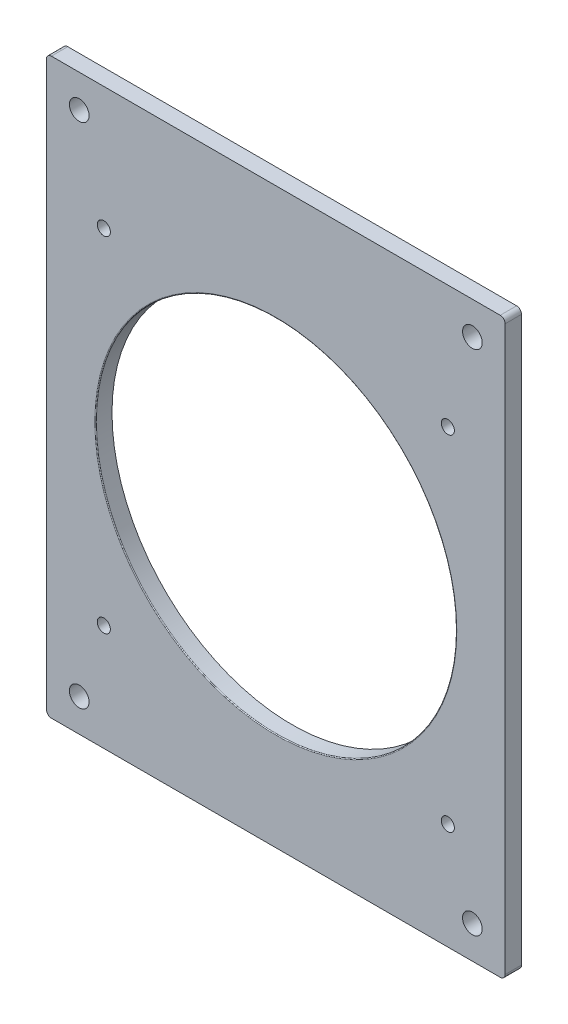
ISO-10303-21;
HEADER;
FILE_DESCRIPTION(('STEP AP214'),'2;1');
FILE_NAME('part.step','',(''),(''),'','','');
FILE_SCHEMA(('AUTOMOTIVE_DESIGN { 1 0 10303 214 1 1 1 1 }'));
ENDSEC;
DATA;
#1=APPLICATION_CONTEXT('core data for automotive mechanical design processes');
#2=APPLICATION_PROTOCOL_DEFINITION('international standard','automotive_design',2000,#1);
#3=PRODUCT_CONTEXT('',#1,'mechanical');
#4=PRODUCT('Part','Part','',(#3));
#5=PRODUCT_RELATED_PRODUCT_CATEGORY('part','',(#4));
#6=PRODUCT_DEFINITION_FORMATION('','',#4);
#7=PRODUCT_DEFINITION_CONTEXT('part definition',#1,'design');
#8=PRODUCT_DEFINITION('design','',#6,#7);
#9=PRODUCT_DEFINITION_SHAPE('','',#8);
#10=(LENGTH_UNIT() NAMED_UNIT(*) SI_UNIT(.MILLI.,.METRE.));
#11=(NAMED_UNIT(*) PLANE_ANGLE_UNIT() SI_UNIT($,.RADIAN.));
#12=(NAMED_UNIT(*) SI_UNIT($,.STERADIAN.) SOLID_ANGLE_UNIT());
#13=UNCERTAINTY_MEASURE_WITH_UNIT(LENGTH_MEASURE(1.E-05),#10,'distance_accuracy_value','');
#14=(GEOMETRIC_REPRESENTATION_CONTEXT(3) GLOBAL_UNCERTAINTY_ASSIGNED_CONTEXT((#13)) GLOBAL_UNIT_ASSIGNED_CONTEXT((#10,
#11,#12)) REPRESENTATION_CONTEXT('',''));
#15=CARTESIAN_POINT('',(0.,0.,0.));
#16=DIRECTION('',(0.,0.,1.));
#17=DIRECTION('',(1.,0.,0.));
#18=AXIS2_PLACEMENT_3D('',#15,#16,#17);
#19=CARTESIAN_POINT('',(68.,-87.5,5.));
#20=DIRECTION('',(0.,1.,0.));
#21=DIRECTION('',(0.,0.,1.));
#22=AXIS2_PLACEMENT_3D('',#19,#20,#21);
#23=PLANE('',#22);
#24=DIRECTION('',(1.,0.,0.));
#25=VECTOR('',#24,1.);
#26=CARTESIAN_POINT('',(68.,-87.5,0.));
#27=LINE('',#26,#25);
#28=CARTESIAN_POINT('',(-68.5,-87.5,0.));
#29=VERTEX_POINT('',#28);
#30=CARTESIAN_POINT('',(68.5,-87.5,0.));
#31=VERTEX_POINT('',#30);
#32=EDGE_CURVE('E100',#29,#31,#27,.T.);
#33=ORIENTED_EDGE('',*,*,#32,.T.);
#34=DIRECTION('',(0.,0.,-1.));
#35=VECTOR('',#34,1.);
#36=CARTESIAN_POINT('',(68.5,-87.5,5.));
#37=LINE('',#36,#35);
#38=CARTESIAN_POINT('',(68.5,-87.5,5.));
#39=VERTEX_POINT('',#38);
#40=EDGE_CURVE('E193',#39,#31,#37,.T.);
#41=ORIENTED_EDGE('',*,*,#40,.F.);
#42=DIRECTION('',(1.,0.,0.));
#43=VECTOR('',#42,1.);
#44=CARTESIAN_POINT('',(-68.,-87.5,5.));
#45=LINE('',#44,#43);
#46=CARTESIAN_POINT('',(-68.5,-87.5,5.));
#47=VERTEX_POINT('',#46);
#48=EDGE_CURVE('E107',#47,#39,#45,.T.);
#49=ORIENTED_EDGE('',*,*,#48,.F.);
#50=DIRECTION('',(0.,0.,-1.));
#51=VECTOR('',#50,1.);
#52=CARTESIAN_POINT('',(-68.5,-87.5,5.));
#53=LINE('',#52,#51);
#54=EDGE_CURVE('E148',#47,#29,#53,.T.);
#55=ORIENTED_EDGE('',*,*,#54,.T.);
#56=EDGE_LOOP('',(#33,#41,#49,#55));
#57=FACE_BOUND('',#56,.T.);
#58=ADVANCED_FACE('F38',(#57),#23,.F.);
#59=CARTESIAN_POINT('',(68.5,-86.,5.));
#60=DIRECTION('',(0.,0.,-1.));
#61=DIRECTION('',(-1.,0.,0.));
#62=AXIS2_PLACEMENT_3D('',#59,#60,#61);
#63=CYLINDRICAL_SURFACE('',#62,1.49999999999999);
#64=CARTESIAN_POINT('',(68.5,-86.,0.));
#65=DIRECTION('',(0.,0.,1.));
#66=DIRECTION('',(1.,0.,0.));
#67=AXIS2_PLACEMENT_3D('',#64,#65,#66);
#68=CIRCLE('',#67,1.49999999999999);
#69=CARTESIAN_POINT('',(70.,-86.,0.));
#70=VERTEX_POINT('',#69);
#71=EDGE_CURVE('E154',#31,#70,#68,.T.);
#72=ORIENTED_EDGE('',*,*,#71,.T.);
#73=DIRECTION('',(0.,0.,-1.));
#74=VECTOR('',#73,1.);
#75=CARTESIAN_POINT('',(70.,-86.,5.));
#76=LINE('',#75,#74);
#77=CARTESIAN_POINT('',(70.,-86.,5.));
#78=VERTEX_POINT('',#77);
#79=EDGE_CURVE('E189',#78,#70,#76,.T.);
#80=ORIENTED_EDGE('',*,*,#79,.F.);
#81=CARTESIAN_POINT('',(68.5,-86.,5.));
#82=DIRECTION('',(0.,0.,1.));
#83=DIRECTION('',(1.,0.,0.));
#84=AXIS2_PLACEMENT_3D('',#81,#82,#83);
#85=CIRCLE('',#84,1.49999999999999);
#86=EDGE_CURVE('E345',#39,#78,#85,.T.);
#87=ORIENTED_EDGE('',*,*,#86,.F.);
#88=ORIENTED_EDGE('',*,*,#40,.T.);
#89=EDGE_LOOP('',(#72,#80,#87,#88));
#90=FACE_BOUND('',#89,.T.);
#91=ADVANCED_FACE('F227',(#90),#63,.T.);
#92=CARTESIAN_POINT('',(70.,86.,5.));
#93=DIRECTION('',(-1.,0.,0.));
#94=DIRECTION('',(0.,-1.,0.));
#95=AXIS2_PLACEMENT_3D('',#92,#93,#94);
#96=PLANE('',#95);
#97=DIRECTION('',(0.,1.,0.));
#98=VECTOR('',#97,1.);
#99=CARTESIAN_POINT('',(70.,86.,0.));
#100=LINE('',#99,#98);
#101=CARTESIAN_POINT('',(70.,86.,0.));
#102=VERTEX_POINT('',#101);
#103=EDGE_CURVE('E159',#70,#102,#100,.T.);
#104=ORIENTED_EDGE('',*,*,#103,.T.);
#105=DIRECTION('',(0.,0.,-1.));
#106=VECTOR('',#105,1.);
#107=CARTESIAN_POINT('',(70.,86.,5.));
#108=LINE('',#107,#106);
#109=CARTESIAN_POINT('',(70.,86.,5.));
#110=VERTEX_POINT('',#109);
#111=EDGE_CURVE('E185',#110,#102,#108,.T.);
#112=ORIENTED_EDGE('',*,*,#111,.F.);
#113=DIRECTION('',(0.,1.,0.));
#114=VECTOR('',#113,1.);
#115=CARTESIAN_POINT('',(70.,-86.,5.));
#116=LINE('',#115,#114);
#117=EDGE_CURVE('E348',#78,#110,#116,.T.);
#118=ORIENTED_EDGE('',*,*,#117,.F.);
#119=ORIENTED_EDGE('',*,*,#79,.T.);
#120=EDGE_LOOP('',(#104,#112,#118,#119));
#121=FACE_BOUND('',#120,.T.);
#122=ADVANCED_FACE('F232',(#121),#96,.F.);
#123=CARTESIAN_POINT('',(68.5,86.,5.));
#124=DIRECTION('',(0.,0.,-1.));
#125=DIRECTION('',(-1.,0.,0.));
#126=AXIS2_PLACEMENT_3D('',#123,#124,#125);
#127=CYLINDRICAL_SURFACE('',#126,1.49999999999999);
#128=CARTESIAN_POINT('',(68.5,86.,0.));
#129=DIRECTION('',(0.,0.,1.));
#130=DIRECTION('',(-1.,0.,0.));
#131=AXIS2_PLACEMENT_3D('',#128,#129,#130);
#132=CIRCLE('',#131,1.49999999999999);
#133=CARTESIAN_POINT('',(68.5,87.5,0.));
#134=VERTEX_POINT('',#133);
#135=EDGE_CURVE('E162',#102,#134,#132,.T.);
#136=ORIENTED_EDGE('',*,*,#135,.T.);
#137=DIRECTION('',(0.,0.,-1.));
#138=VECTOR('',#137,1.);
#139=CARTESIAN_POINT('',(68.5,87.5,5.));
#140=LINE('',#139,#138);
#141=CARTESIAN_POINT('',(68.5,87.5,5.));
#142=VERTEX_POINT('',#141);
#143=EDGE_CURVE('E181',#142,#134,#140,.T.);
#144=ORIENTED_EDGE('',*,*,#143,.F.);
#145=CARTESIAN_POINT('',(68.5,86.,5.));
#146=DIRECTION('',(0.,0.,1.));
#147=DIRECTION('',(-1.,0.,0.));
#148=AXIS2_PLACEMENT_3D('',#145,#146,#147);
#149=CIRCLE('',#148,1.49999999999999);
#150=EDGE_CURVE('E351',#110,#142,#149,.T.);
#151=ORIENTED_EDGE('',*,*,#150,.F.);
#152=ORIENTED_EDGE('',*,*,#111,.T.);
#153=EDGE_LOOP('',(#136,#144,#151,#152));
#154=FACE_BOUND('',#153,.T.);
#155=ADVANCED_FACE('F238',(#154),#127,.T.);
#156=CARTESIAN_POINT('',(-68.,87.5,5.));
#157=DIRECTION('',(0.,-1.,0.));
#158=DIRECTION('',(0.,0.,-1.));
#159=AXIS2_PLACEMENT_3D('',#156,#157,#158);
#160=PLANE('',#159);
#161=DIRECTION('',(-1.,0.,0.));
#162=VECTOR('',#161,1.);
#163=CARTESIAN_POINT('',(-68.,87.5,0.));
#164=LINE('',#163,#162);
#165=CARTESIAN_POINT('',(-68.5,87.5,0.));
#166=VERTEX_POINT('',#165);
#167=EDGE_CURVE('E166',#134,#166,#164,.T.);
#168=ORIENTED_EDGE('',*,*,#167,.T.);
#169=DIRECTION('',(0.,0.,-1.));
#170=VECTOR('',#169,1.);
#171=CARTESIAN_POINT('',(-68.5,87.5,5.));
#172=LINE('',#171,#170);
#173=CARTESIAN_POINT('',(-68.5,87.5,5.));
#174=VERTEX_POINT('',#173);
#175=EDGE_CURVE('E139',#174,#166,#172,.T.);
#176=ORIENTED_EDGE('',*,*,#175,.F.);
#177=DIRECTION('',(-1.,0.,0.));
#178=VECTOR('',#177,1.);
#179=CARTESIAN_POINT('',(68.,87.5,5.));
#180=LINE('',#179,#178);
#181=EDGE_CURVE('E129',#142,#174,#180,.T.);
#182=ORIENTED_EDGE('',*,*,#181,.F.);
#183=ORIENTED_EDGE('',*,*,#143,.T.);
#184=EDGE_LOOP('',(#168,#176,#182,#183));
#185=FACE_BOUND('',#184,.T.);
#186=ADVANCED_FACE('F242',(#185),#160,.F.);
#187=CARTESIAN_POINT('',(-68.5,86.,5.));
#188=DIRECTION('',(0.,0.,-1.));
#189=DIRECTION('',(-1.,0.,0.));
#190=AXIS2_PLACEMENT_3D('',#187,#188,#189);
#191=CYLINDRICAL_SURFACE('',#190,1.5);
#192=CARTESIAN_POINT('',(-68.5,86.,0.));
#193=DIRECTION('',(0.,0.,1.));
#194=DIRECTION('',(1.,0.,0.));
#195=AXIS2_PLACEMENT_3D('',#192,#193,#194);
#196=CIRCLE('',#195,1.5);
#197=CARTESIAN_POINT('',(-70.,86.,0.));
#198=VERTEX_POINT('',#197);
#199=EDGE_CURVE('E138',#166,#198,#196,.T.);
#200=ORIENTED_EDGE('',*,*,#199,.T.);
#201=DIRECTION('',(0.,0.,-1.));
#202=VECTOR('',#201,1.);
#203=CARTESIAN_POINT('',(-70.,86.,5.));
#204=LINE('',#203,#202);
#205=CARTESIAN_POINT('',(-70.,86.,5.));
#206=VERTEX_POINT('',#205);
#207=EDGE_CURVE('E135',#206,#198,#204,.T.);
#208=ORIENTED_EDGE('',*,*,#207,.F.);
#209=CARTESIAN_POINT('',(-68.5,86.,5.));
#210=DIRECTION('',(0.,0.,1.));
#211=DIRECTION('',(1.,0.,0.));
#212=AXIS2_PLACEMENT_3D('',#209,#210,#211);
#213=CIRCLE('',#212,1.5);
#214=EDGE_CURVE('E123',#174,#206,#213,.T.);
#215=ORIENTED_EDGE('',*,*,#214,.F.);
#216=ORIENTED_EDGE('',*,*,#175,.T.);
#217=EDGE_LOOP('',(#200,#208,#215,#216));
#218=FACE_BOUND('',#217,.T.);
#219=ADVANCED_FACE('F136',(#218),#191,.T.);
#220=CARTESIAN_POINT('',(-70.,-86.,5.));
#221=DIRECTION('',(1.,0.,0.));
#222=DIRECTION('',(0.,0.,-1.));
#223=AXIS2_PLACEMENT_3D('',#220,#221,#222);
#224=PLANE('',#223);
#225=DIRECTION('',(0.,-1.,0.));
#226=VECTOR('',#225,1.);
#227=CARTESIAN_POINT('',(-70.,-86.,0.));
#228=LINE('',#227,#226);
#229=CARTESIAN_POINT('',(-70.,-86.,0.));
#230=VERTEX_POINT('',#229);
#231=EDGE_CURVE('E93',#198,#230,#228,.T.);
#232=ORIENTED_EDGE('',*,*,#231,.T.);
#233=DIRECTION('',(0.,0.,-1.));
#234=VECTOR('',#233,1.);
#235=CARTESIAN_POINT('',(-70.,-86.,5.));
#236=LINE('',#235,#234);
#237=CARTESIAN_POINT('',(-70.,-86.,5.));
#238=VERTEX_POINT('',#237);
#239=EDGE_CURVE('E140',#238,#230,#236,.T.);
#240=ORIENTED_EDGE('',*,*,#239,.F.);
#241=DIRECTION('',(0.,-1.,0.));
#242=VECTOR('',#241,1.);
#243=CARTESIAN_POINT('',(-70.,86.,5.));
#244=LINE('',#243,#242);
#245=EDGE_CURVE('E127',#206,#238,#244,.T.);
#246=ORIENTED_EDGE('',*,*,#245,.F.);
#247=ORIENTED_EDGE('',*,*,#207,.T.);
#248=EDGE_LOOP('',(#232,#240,#246,#247));
#249=FACE_BOUND('',#248,.T.);
#250=ADVANCED_FACE('F142',(#249),#224,.F.);
#251=CARTESIAN_POINT('',(-68.5,-86.,5.));
#252=DIRECTION('',(0.,0.,-1.));
#253=DIRECTION('',(-1.,0.,0.));
#254=AXIS2_PLACEMENT_3D('',#251,#252,#253);
#255=CYLINDRICAL_SURFACE('',#254,1.5);
#256=CARTESIAN_POINT('',(-68.5,-86.,0.));
#257=DIRECTION('',(0.,0.,1.));
#258=DIRECTION('',(-1.,0.,0.));
#259=AXIS2_PLACEMENT_3D('',#256,#257,#258);
#260=CIRCLE('',#259,1.5);
#261=EDGE_CURVE('E172',#230,#29,#260,.T.);
#262=ORIENTED_EDGE('',*,*,#261,.T.);
#263=ORIENTED_EDGE('',*,*,#54,.F.);
#264=CARTESIAN_POINT('',(-68.5,-86.,5.));
#265=DIRECTION('',(0.,0.,1.));
#266=DIRECTION('',(-1.,0.,0.));
#267=AXIS2_PLACEMENT_3D('',#264,#265,#266);
#268=CIRCLE('',#267,1.5);
#269=EDGE_CURVE('E59',#238,#47,#268,.T.);
#270=ORIENTED_EDGE('',*,*,#269,.F.);
#271=ORIENTED_EDGE('',*,*,#239,.T.);
#272=EDGE_LOOP('',(#262,#263,#270,#271));
#273=FACE_BOUND('',#272,.T.);
#274=ADVANCED_FACE('F251',(#273),#255,.T.);
#275=CARTESIAN_POINT('',(-68.5,-86.,5.));
#276=DIRECTION('',(0.,0.,-1.));
#277=DIRECTION('',(-1.,0.,0.));
#278=AXIS2_PLACEMENT_3D('',#275,#276,#277);
#279=PLANE('',#278);
#280=CARTESIAN_POINT('',(0.,-2.50000000000044,5.));
#281=DIRECTION('',(0.,0.,-1.));
#282=DIRECTION('',(-1.,0.,0.));
#283=AXIS2_PLACEMENT_3D('',#280,#281,#282);
#284=CIRCLE('',#283,55.25);
#285=CARTESIAN_POINT('',(-55.25,-2.50000000000044,5.));
#286=VERTEX_POINT('',#285);
#287=EDGE_CURVE('E48',#286,#286,#284,.T.);
#288=ORIENTED_EDGE('',*,*,#287,.T.);
#289=EDGE_LOOP('',(#288));
#290=FACE_BOUND('',#289,.T.);
#291=CARTESIAN_POINT('',(-52.5,49.9999999999996,5.));
#292=DIRECTION('',(0.,0.,-1.));
#293=DIRECTION('',(-1.,0.,0.));
#294=AXIS2_PLACEMENT_3D('',#291,#292,#293);
#295=CIRCLE('',#294,2.);
#296=CARTESIAN_POINT('',(-54.5,49.9999999999996,5.));
#297=VERTEX_POINT('',#296);
#298=EDGE_CURVE('E328',#297,#297,#295,.T.);
#299=ORIENTED_EDGE('',*,*,#298,.T.);
#300=EDGE_LOOP('',(#299));
#301=FACE_BOUND('',#300,.T.);
#302=CARTESIAN_POINT('',(-52.5,-55.0000000000004,5.));
#303=DIRECTION('',(0.,0.,-1.));
#304=DIRECTION('',(-1.,0.,0.));
#305=AXIS2_PLACEMENT_3D('',#302,#303,#304);
#306=CIRCLE('',#305,2.);
#307=CARTESIAN_POINT('',(-54.5,-55.0000000000004,5.));
#308=VERTEX_POINT('',#307);
#309=EDGE_CURVE('E324',#308,#308,#306,.T.);
#310=ORIENTED_EDGE('',*,*,#309,.T.);
#311=EDGE_LOOP('',(#310));
#312=FACE_BOUND('',#311,.T.);
#313=CARTESIAN_POINT('',(52.5,-55.0000000000004,5.));
#314=DIRECTION('',(0.,0.,-1.));
#315=DIRECTION('',(-1.,0.,0.));
#316=AXIS2_PLACEMENT_3D('',#313,#314,#315);
#317=CIRCLE('',#316,2.);
#318=CARTESIAN_POINT('',(50.5,-55.0000000000004,5.));
#319=VERTEX_POINT('',#318);
#320=EDGE_CURVE('E320',#319,#319,#317,.T.);
#321=ORIENTED_EDGE('',*,*,#320,.T.);
#322=EDGE_LOOP('',(#321));
#323=FACE_BOUND('',#322,.T.);
#324=CARTESIAN_POINT('',(52.5,49.9999999999996,5.));
#325=DIRECTION('',(0.,0.,-1.));
#326=DIRECTION('',(-1.,0.,0.));
#327=AXIS2_PLACEMENT_3D('',#324,#325,#326);
#328=CIRCLE('',#327,2.);
#329=CARTESIAN_POINT('',(50.5,49.9999999999996,5.));
#330=VERTEX_POINT('',#329);
#331=EDGE_CURVE('E316',#330,#330,#328,.T.);
#332=ORIENTED_EDGE('',*,*,#331,.T.);
#333=EDGE_LOOP('',(#332));
#334=FACE_BOUND('',#333,.T.);
#335=CARTESIAN_POINT('',(60.0000000000002,-77.5000000000003,5.));
#336=DIRECTION('',(0.,0.,1.));
#337=DIRECTION('',(1.,0.,0.));
#338=AXIS2_PLACEMENT_3D('',#335,#336,#337);
#339=CIRCLE('',#338,3.00000000000001);
#340=CARTESIAN_POINT('',(63.0000000000002,-77.5000000000003,5.));
#341=VERTEX_POINT('',#340);
#342=EDGE_CURVE('E336',#341,#341,#339,.T.);
#343=ORIENTED_EDGE('',*,*,#342,.F.);
#344=EDGE_LOOP('',(#343));
#345=FACE_BOUND('',#344,.T.);
#346=CARTESIAN_POINT('',(-60.,77.4999999999997,5.));
#347=DIRECTION('',(0.,0.,1.));
#348=DIRECTION('',(1.,0.,0.));
#349=AXIS2_PLACEMENT_3D('',#346,#347,#348);
#350=CIRCLE('',#349,3.);
#351=CARTESIAN_POINT('',(-57.,77.4999999999997,5.));
#352=VERTEX_POINT('',#351);
#353=EDGE_CURVE('E335',#352,#352,#350,.T.);
#354=ORIENTED_EDGE('',*,*,#353,.F.);
#355=EDGE_LOOP('',(#354));
#356=FACE_BOUND('',#355,.T.);
#357=CARTESIAN_POINT('',(60.,77.4999999999997,5.));
#358=DIRECTION('',(0.,0.,1.));
#359=DIRECTION('',(1.,0.,0.));
#360=AXIS2_PLACEMENT_3D('',#357,#358,#359);
#361=CIRCLE('',#360,3.00000000000001);
#362=CARTESIAN_POINT('',(63.,77.4999999999997,5.));
#363=VERTEX_POINT('',#362);
#364=EDGE_CURVE('E331',#363,#363,#361,.T.);
#365=ORIENTED_EDGE('',*,*,#364,.F.);
#366=EDGE_LOOP('',(#365));
#367=FACE_BOUND('',#366,.T.);
#368=CARTESIAN_POINT('',(-60.,-77.5000000000003,5.));
#369=DIRECTION('',(0.,0.,1.));
#370=DIRECTION('',(1.,0.,0.));
#371=AXIS2_PLACEMENT_3D('',#368,#369,#370);
#372=CIRCLE('',#371,3.);
#373=CARTESIAN_POINT('',(-57.,-77.5000000000003,5.));
#374=VERTEX_POINT('',#373);
#375=EDGE_CURVE('E201',#374,#374,#372,.T.);
#376=ORIENTED_EDGE('',*,*,#375,.F.);
#377=EDGE_LOOP('',(#376));
#378=FACE_BOUND('',#377,.T.);
#379=ORIENTED_EDGE('',*,*,#48,.T.);
#380=ORIENTED_EDGE('',*,*,#86,.T.);
#381=ORIENTED_EDGE('',*,*,#117,.T.);
#382=ORIENTED_EDGE('',*,*,#150,.T.);
#383=ORIENTED_EDGE('',*,*,#181,.T.);
#384=ORIENTED_EDGE('',*,*,#214,.T.);
#385=ORIENTED_EDGE('',*,*,#245,.T.);
#386=ORIENTED_EDGE('',*,*,#269,.T.);
#387=EDGE_LOOP('',(#379,#380,#381,#382,#383,#384,#385,#386));
#388=FACE_BOUND('',#387,.T.);
#389=ADVANCED_FACE('F125',(#290,#301,#312,#323,#334,#345,#356,#367,#378,#388),#279,.F.);
#390=CARTESIAN_POINT('',(-68.5,-86.,0.));
#391=DIRECTION('',(0.,0.,-1.));
#392=DIRECTION('',(-1.,0.,0.));
#393=AXIS2_PLACEMENT_3D('',#390,#391,#392);
#394=PLANE('',#393);
#395=CARTESIAN_POINT('',(-52.5,49.9999999999996,0.));
#396=DIRECTION('',(0.,0.,-1.));
#397=DIRECTION('',(-1.,0.,0.));
#398=AXIS2_PLACEMENT_3D('',#395,#396,#397);
#399=CIRCLE('',#398,2.);
#400=CARTESIAN_POINT('',(-54.5,49.9999999999996,0.));
#401=VERTEX_POINT('',#400);
#402=EDGE_CURVE('E305',#401,#401,#399,.T.);
#403=ORIENTED_EDGE('',*,*,#402,.F.);
#404=EDGE_LOOP('',(#403));
#405=FACE_BOUND('',#404,.T.);
#406=CARTESIAN_POINT('',(-52.5,-55.0000000000004,0.));
#407=DIRECTION('',(0.,0.,-1.));
#408=DIRECTION('',(-1.,0.,0.));
#409=AXIS2_PLACEMENT_3D('',#406,#407,#408);
#410=CIRCLE('',#409,2.);
#411=CARTESIAN_POINT('',(-54.5,-55.0000000000004,0.));
#412=VERTEX_POINT('',#411);
#413=EDGE_CURVE('E302',#412,#412,#410,.T.);
#414=ORIENTED_EDGE('',*,*,#413,.F.);
#415=EDGE_LOOP('',(#414));
#416=FACE_BOUND('',#415,.T.);
#417=CARTESIAN_POINT('',(0.,-2.50000000000044,0.));
#418=DIRECTION('',(0.,0.,-1.));
#419=DIRECTION('',(-1.,0.,0.));
#420=AXIS2_PLACEMENT_3D('',#417,#418,#419);
#421=CIRCLE('',#420,55.);
#422=CARTESIAN_POINT('',(-55.,-2.50000000000044,0.));
#423=VERTEX_POINT('',#422);
#424=EDGE_CURVE('E296',#423,#423,#421,.T.);
#425=ORIENTED_EDGE('',*,*,#424,.F.);
#426=EDGE_LOOP('',(#425));
#427=FACE_BOUND('',#426,.T.);
#428=CARTESIAN_POINT('',(52.5,-55.0000000000004,0.));
#429=DIRECTION('',(0.,0.,-1.));
#430=DIRECTION('',(-1.,0.,0.));
#431=AXIS2_PLACEMENT_3D('',#428,#429,#430);
#432=CIRCLE('',#431,2.);
#433=CARTESIAN_POINT('',(50.5,-55.0000000000004,0.));
#434=VERTEX_POINT('',#433);
#435=EDGE_CURVE('E298',#434,#434,#432,.T.);
#436=ORIENTED_EDGE('',*,*,#435,.F.);
#437=EDGE_LOOP('',(#436));
#438=FACE_BOUND('',#437,.T.);
#439=CARTESIAN_POINT('',(52.5,49.9999999999996,0.));
#440=DIRECTION('',(0.,0.,-1.));
#441=DIRECTION('',(-1.,0.,0.));
#442=AXIS2_PLACEMENT_3D('',#439,#440,#441);
#443=CIRCLE('',#442,2.);
#444=CARTESIAN_POINT('',(50.5,49.9999999999996,0.));
#445=VERTEX_POINT('',#444);
#446=EDGE_CURVE('E309',#445,#445,#443,.T.);
#447=ORIENTED_EDGE('',*,*,#446,.F.);
#448=EDGE_LOOP('',(#447));
#449=FACE_BOUND('',#448,.T.);
#450=CARTESIAN_POINT('',(60.0000000000002,-77.5000000000003,0.));
#451=DIRECTION('',(0.,0.,-1.));
#452=DIRECTION('',(-1.,0.,0.));
#453=AXIS2_PLACEMENT_3D('',#450,#451,#452);
#454=CIRCLE('',#453,3.00000000000001);
#455=CARTESIAN_POINT('',(57.0000000000002,-77.5000000000003,0.));
#456=VERTEX_POINT('',#455);
#457=EDGE_CURVE('E155',#456,#456,#454,.T.);
#458=ORIENTED_EDGE('',*,*,#457,.F.);
#459=EDGE_LOOP('',(#458));
#460=FACE_BOUND('',#459,.T.);
#461=CARTESIAN_POINT('',(-60.,77.4999999999997,0.));
#462=DIRECTION('',(0.,0.,-1.));
#463=DIRECTION('',(-1.,0.,0.));
#464=AXIS2_PLACEMENT_3D('',#461,#462,#463);
#465=CIRCLE('',#464,3.);
#466=CARTESIAN_POINT('',(-63.,77.4999999999997,0.));
#467=VERTEX_POINT('',#466);
#468=EDGE_CURVE('E205',#467,#467,#465,.T.);
#469=ORIENTED_EDGE('',*,*,#468,.F.);
#470=EDGE_LOOP('',(#469));
#471=FACE_BOUND('',#470,.T.);
#472=CARTESIAN_POINT('',(60.,77.4999999999997,0.));
#473=DIRECTION('',(0.,0.,-1.));
#474=DIRECTION('',(-1.,0.,0.));
#475=AXIS2_PLACEMENT_3D('',#472,#473,#474);
#476=CIRCLE('',#475,3.00000000000001);
#477=CARTESIAN_POINT('',(57.,77.4999999999997,0.));
#478=VERTEX_POINT('',#477);
#479=EDGE_CURVE('E200',#478,#478,#476,.T.);
#480=ORIENTED_EDGE('',*,*,#479,.F.);
#481=EDGE_LOOP('',(#480));
#482=FACE_BOUND('',#481,.T.);
#483=CARTESIAN_POINT('',(-60.,-77.5000000000003,0.));
#484=DIRECTION('',(0.,0.,-1.));
#485=DIRECTION('',(-1.,0.,0.));
#486=AXIS2_PLACEMENT_3D('',#483,#484,#485);
#487=CIRCLE('',#486,3.);
#488=CARTESIAN_POINT('',(-63.,-77.5000000000003,0.));
#489=VERTEX_POINT('',#488);
#490=EDGE_CURVE('E197',#489,#489,#487,.T.);
#491=ORIENTED_EDGE('',*,*,#490,.F.);
#492=EDGE_LOOP('',(#491));
#493=FACE_BOUND('',#492,.T.);
#494=ORIENTED_EDGE('',*,*,#32,.F.);
#495=ORIENTED_EDGE('',*,*,#261,.F.);
#496=ORIENTED_EDGE('',*,*,#231,.F.);
#497=ORIENTED_EDGE('',*,*,#199,.F.);
#498=ORIENTED_EDGE('',*,*,#167,.F.);
#499=ORIENTED_EDGE('',*,*,#135,.F.);
#500=ORIENTED_EDGE('',*,*,#103,.F.);
#501=ORIENTED_EDGE('',*,*,#71,.F.);
#502=EDGE_LOOP('',(#494,#495,#496,#497,#498,#499,#500,#501));
#503=FACE_BOUND('',#502,.T.);
#504=ADVANCED_FACE('F255',(#405,#416,#427,#438,#449,#460,#471,#482,#493,#503),#394,.T.);
#505=CARTESIAN_POINT('',(-60.,-77.5000000000003,-5.));
#506=DIRECTION('',(0.,0.,1.));
#507=DIRECTION('',(1.,0.,0.));
#508=AXIS2_PLACEMENT_3D('',#505,#506,#507);
#509=CYLINDRICAL_SURFACE('',#508,3.);
#510=ORIENTED_EDGE('',*,*,#490,.T.);
#511=EDGE_LOOP('',(#510));
#512=FACE_BOUND('',#511,.T.);
#513=ORIENTED_EDGE('',*,*,#375,.T.);
#514=EDGE_LOOP('',(#513));
#515=FACE_BOUND('',#514,.T.);
#516=ADVANCED_FACE('F258',(#512,#515),#509,.F.);
#517=CARTESIAN_POINT('',(60.,77.4999999999997,-5.));
#518=DIRECTION('',(0.,0.,1.));
#519=DIRECTION('',(1.,0.,0.));
#520=AXIS2_PLACEMENT_3D('',#517,#518,#519);
#521=CYLINDRICAL_SURFACE('',#520,3.00000000000001);
#522=ORIENTED_EDGE('',*,*,#479,.T.);
#523=EDGE_LOOP('',(#522));
#524=FACE_BOUND('',#523,.T.);
#525=ORIENTED_EDGE('',*,*,#364,.T.);
#526=EDGE_LOOP('',(#525));
#527=FACE_BOUND('',#526,.T.);
#528=ADVANCED_FACE('F264',(#524,#527),#521,.F.);
#529=CARTESIAN_POINT('',(-60.,77.4999999999997,-5.));
#530=DIRECTION('',(0.,0.,1.));
#531=DIRECTION('',(1.,0.,0.));
#532=AXIS2_PLACEMENT_3D('',#529,#530,#531);
#533=CYLINDRICAL_SURFACE('',#532,3.);
#534=ORIENTED_EDGE('',*,*,#468,.T.);
#535=EDGE_LOOP('',(#534));
#536=FACE_BOUND('',#535,.T.);
#537=ORIENTED_EDGE('',*,*,#353,.T.);
#538=EDGE_LOOP('',(#537));
#539=FACE_BOUND('',#538,.T.);
#540=ADVANCED_FACE('F266',(#536,#539),#533,.F.);
#541=CARTESIAN_POINT('',(60.0000000000002,-77.5000000000003,-5.));
#542=DIRECTION('',(0.,0.,1.));
#543=DIRECTION('',(1.,0.,0.));
#544=AXIS2_PLACEMENT_3D('',#541,#542,#543);
#545=CYLINDRICAL_SURFACE('',#544,3.00000000000001);
#546=ORIENTED_EDGE('',*,*,#457,.T.);
#547=EDGE_LOOP('',(#546));
#548=FACE_BOUND('',#547,.T.);
#549=ORIENTED_EDGE('',*,*,#342,.T.);
#550=EDGE_LOOP('',(#549));
#551=FACE_BOUND('',#550,.T.);
#552=ADVANCED_FACE('F269',(#548,#551),#545,.F.);
#553=CARTESIAN_POINT('',(52.5,49.9999999999996,10.));
#554=DIRECTION('',(0.,0.,-1.));
#555=DIRECTION('',(-1.,0.,0.));
#556=AXIS2_PLACEMENT_3D('',#553,#554,#555);
#557=CYLINDRICAL_SURFACE('',#556,2.);
#558=ORIENTED_EDGE('',*,*,#446,.T.);
#559=EDGE_LOOP('',(#558));
#560=FACE_BOUND('',#559,.T.);
#561=ORIENTED_EDGE('',*,*,#331,.F.);
#562=EDGE_LOOP('',(#561));
#563=FACE_BOUND('',#562,.T.);
#564=ADVANCED_FACE('F273',(#560,#563),#557,.F.);
#565=CARTESIAN_POINT('',(52.5,-55.0000000000004,10.));
#566=DIRECTION('',(0.,0.,-1.));
#567=DIRECTION('',(-1.,0.,0.));
#568=AXIS2_PLACEMENT_3D('',#565,#566,#567);
#569=CYLINDRICAL_SURFACE('',#568,2.);
#570=ORIENTED_EDGE('',*,*,#435,.T.);
#571=EDGE_LOOP('',(#570));
#572=FACE_BOUND('',#571,.T.);
#573=ORIENTED_EDGE('',*,*,#320,.F.);
#574=EDGE_LOOP('',(#573));
#575=FACE_BOUND('',#574,.T.);
#576=ADVANCED_FACE('F280',(#572,#575),#569,.F.);
#577=CARTESIAN_POINT('',(0.,-2.50000000000044,10.));
#578=DIRECTION('',(0.,0.,-1.));
#579=DIRECTION('',(-1.,0.,0.));
#580=AXIS2_PLACEMENT_3D('',#577,#578,#579);
#581=CYLINDRICAL_SURFACE('',#580,55.);
#582=CARTESIAN_POINT('',(0.,-2.50000000000044,4.75));
#583=DIRECTION('',(0.,0.,-1.));
#584=DIRECTION('',(-1.,0.,0.));
#585=AXIS2_PLACEMENT_3D('',#582,#583,#584);
#586=CIRCLE('',#585,55.);
#587=CARTESIAN_POINT('',(-55.,-2.50000000000044,4.75));
#588=VERTEX_POINT('',#587);
#589=EDGE_CURVE('E11',#588,#588,#586,.F.);
#590=ORIENTED_EDGE('',*,*,#589,.T.);
#591=EDGE_LOOP('',(#590));
#592=FACE_BOUND('',#591,.T.);
#593=ORIENTED_EDGE('',*,*,#424,.T.);
#594=EDGE_LOOP('',(#593));
#595=FACE_BOUND('',#594,.T.);
#596=ADVANCED_FACE('F283',(#592,#595),#581,.F.);
#597=CARTESIAN_POINT('',(-52.5,-55.0000000000004,10.));
#598=DIRECTION('',(0.,0.,-1.));
#599=DIRECTION('',(-1.,0.,0.));
#600=AXIS2_PLACEMENT_3D('',#597,#598,#599);
#601=CYLINDRICAL_SURFACE('',#600,2.);
#602=ORIENTED_EDGE('',*,*,#413,.T.);
#603=EDGE_LOOP('',(#602));
#604=FACE_BOUND('',#603,.T.);
#605=ORIENTED_EDGE('',*,*,#309,.F.);
#606=EDGE_LOOP('',(#605));
#607=FACE_BOUND('',#606,.T.);
#608=ADVANCED_FACE('F222',(#604,#607),#601,.F.);
#609=CARTESIAN_POINT('',(-52.5,49.9999999999996,10.));
#610=DIRECTION('',(0.,0.,-1.));
#611=DIRECTION('',(-1.,0.,0.));
#612=AXIS2_PLACEMENT_3D('',#609,#610,#611);
#613=CYLINDRICAL_SURFACE('',#612,2.);
#614=ORIENTED_EDGE('',*,*,#402,.T.);
#615=EDGE_LOOP('',(#614));
#616=FACE_BOUND('',#615,.T.);
#617=ORIENTED_EDGE('',*,*,#298,.F.);
#618=EDGE_LOOP('',(#617));
#619=FACE_BOUND('',#618,.T.);
#620=ADVANCED_FACE('F217',(#616,#619),#613,.F.);
#621=CARTESIAN_POINT('',(0.,-2.50000000000044,4.75));
#622=DIRECTION('',(0.,0.,-1.));
#623=DIRECTION('',(-1.,0.,0.));
#624=AXIS2_PLACEMENT_3D('',#621,#622,#623);
#625=TOROIDAL_SURFACE('',#624,55.25,0.25);
#626=ORIENTED_EDGE('',*,*,#589,.F.);
#627=EDGE_LOOP('',(#626));
#628=FACE_BOUND('',#627,.T.);
#629=ORIENTED_EDGE('',*,*,#287,.F.);
#630=EDGE_LOOP('',(#629));
#631=FACE_BOUND('',#630,.T.);
#632=ADVANCED_FACE('F40',(#628,#631),#625,.T.);
#633=CLOSED_SHELL('',(#58,#91,#122,#155,#186,#219,#250,#274,#389,#504,#516,#528,#540,#552,#564,
#576,#596,#608,#620,#632));
#634=MANIFOLD_SOLID_BREP('B2',#633);
#635=ADVANCED_BREP_SHAPE_REPRESENTATION('',(#18,#634),#14);
#636=SHAPE_DEFINITION_REPRESENTATION(#9,#635);
ENDSEC;
END-ISO-10303-21;
